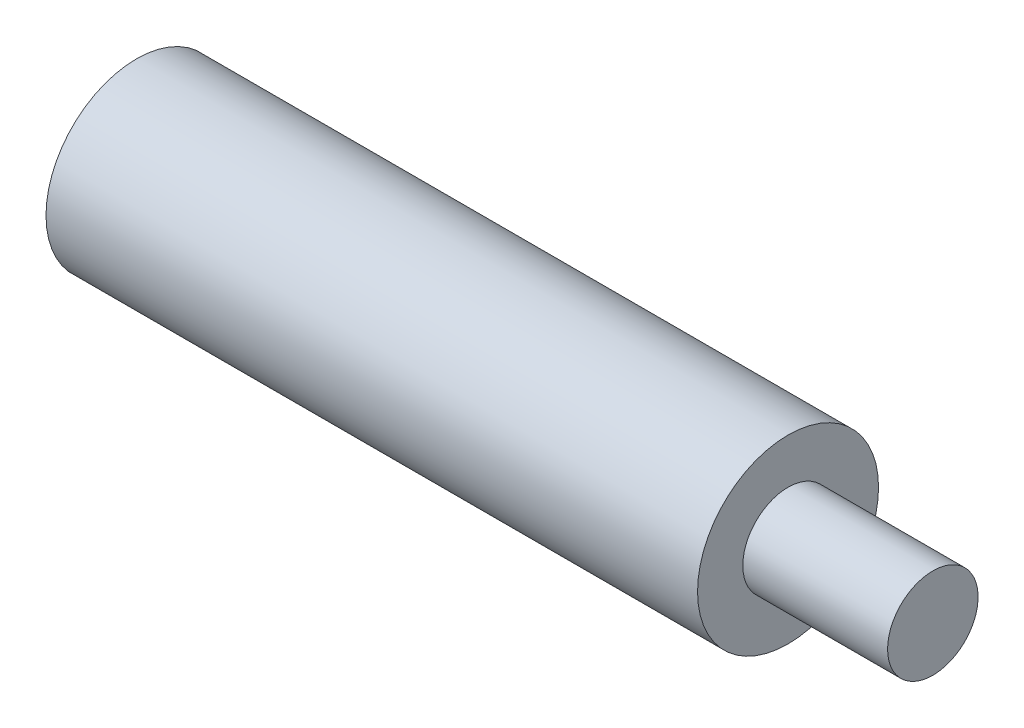
ISO-10303-21;
HEADER;
FILE_DESCRIPTION(('STEP AP214'),'2;1');
FILE_NAME('part.step','',(''),(''),'','','');
FILE_SCHEMA(('AUTOMOTIVE_DESIGN { 1 0 10303 214 1 1 1 1 }'));
ENDSEC;
DATA;
#1=APPLICATION_CONTEXT('core data for automotive mechanical design processes');
#2=APPLICATION_PROTOCOL_DEFINITION('international standard','automotive_design',2000,#1);
#3=PRODUCT_CONTEXT('',#1,'mechanical');
#4=PRODUCT('Part','Part','',(#3));
#5=PRODUCT_RELATED_PRODUCT_CATEGORY('part','',(#4));
#6=PRODUCT_DEFINITION_FORMATION('','',#4);
#7=PRODUCT_DEFINITION_CONTEXT('part definition',#1,'design');
#8=PRODUCT_DEFINITION('design','',#6,#7);
#9=PRODUCT_DEFINITION_SHAPE('','',#8);
#10=(LENGTH_UNIT() NAMED_UNIT(*) SI_UNIT(.MILLI.,.METRE.));
#11=(NAMED_UNIT(*) PLANE_ANGLE_UNIT() SI_UNIT($,.RADIAN.));
#12=(NAMED_UNIT(*) SI_UNIT($,.STERADIAN.) SOLID_ANGLE_UNIT());
#13=UNCERTAINTY_MEASURE_WITH_UNIT(LENGTH_MEASURE(1.E-05),#10,'distance_accuracy_value','');
#14=(GEOMETRIC_REPRESENTATION_CONTEXT(3) GLOBAL_UNCERTAINTY_ASSIGNED_CONTEXT((#13)) GLOBAL_UNIT_ASSIGNED_CONTEXT((#10,
#11,#12)) REPRESENTATION_CONTEXT('',''));
#15=CARTESIAN_POINT('',(0.,0.,0.));
#16=DIRECTION('',(0.,0.,1.));
#17=DIRECTION('',(1.,0.,0.));
#18=AXIS2_PLACEMENT_3D('',#15,#16,#17);
#19=CARTESIAN_POINT('',(0.,0.,0.));
#20=DIRECTION('',(1.,0.,0.));
#21=DIRECTION('',(0.,0.,-1.));
#22=AXIS2_PLACEMENT_3D('',#19,#20,#21);
#23=PLANE('',#22);
#24=CARTESIAN_POINT('',(0.,0.,0.));
#25=DIRECTION('',(-1.,0.,0.));
#26=DIRECTION('',(0.,0.,1.));
#27=AXIS2_PLACEMENT_3D('',#24,#25,#26);
#28=CIRCLE('',#27,2.09999999999999);
#29=CARTESIAN_POINT('',(0.,0.,2.09999999999999));
#30=VERTEX_POINT('',#29);
#31=EDGE_CURVE('E59',#30,#30,#28,.T.);
#32=ORIENTED_EDGE('',*,*,#31,.F.);
#33=EDGE_LOOP('',(#32));
#34=FACE_BOUND('',#33,.T.);
#35=CARTESIAN_POINT('',(0.,0.,0.));
#36=DIRECTION('',(-1.,0.,0.));
#37=DIRECTION('',(0.,0.,1.));
#38=AXIS2_PLACEMENT_3D('',#35,#36,#37);
#39=CIRCLE('',#38,5.);
#40=CARTESIAN_POINT('',(0.,0.,5.));
#41=VERTEX_POINT('',#40);
#42=EDGE_CURVE('E11',#41,#41,#39,.T.);
#43=ORIENTED_EDGE('',*,*,#42,.T.);
#44=EDGE_LOOP('',(#43));
#45=FACE_BOUND('',#44,.T.);
#46=ADVANCED_FACE('F39',(#34,#45),#23,.F.);
#47=CARTESIAN_POINT('',(0.,0.,0.));
#48=DIRECTION('',(-1.,0.,0.));
#49=DIRECTION('',(0.,0.,1.));
#50=AXIS2_PLACEMENT_3D('',#47,#48,#49);
#51=CYLINDRICAL_SURFACE('',#50,5.);
#52=ORIENTED_EDGE('',*,*,#42,.F.);
#53=EDGE_LOOP('',(#52));
#54=FACE_BOUND('',#53,.T.);
#55=CARTESIAN_POINT('',(36.,0.,0.));
#56=DIRECTION('',(-1.,0.,0.));
#57=DIRECTION('',(0.,0.,1.));
#58=AXIS2_PLACEMENT_3D('',#55,#56,#57);
#59=CIRCLE('',#58,5.);
#60=CARTESIAN_POINT('',(36.,0.,5.));
#61=VERTEX_POINT('',#60);
#62=EDGE_CURVE('E45',#61,#61,#59,.T.);
#63=ORIENTED_EDGE('',*,*,#62,.T.);
#64=EDGE_LOOP('',(#63));
#65=FACE_BOUND('',#64,.T.);
#66=ADVANCED_FACE('F71',(#54,#65),#51,.T.);
#67=CARTESIAN_POINT('',(36.,5.,0.));
#68=DIRECTION('',(-1.,0.,0.));
#69=DIRECTION('',(0.,0.,1.));
#70=AXIS2_PLACEMENT_3D('',#67,#68,#69);
#71=PLANE('',#70);
#72=ORIENTED_EDGE('',*,*,#62,.F.);
#73=EDGE_LOOP('',(#72));
#74=FACE_BOUND('',#73,.T.);
#75=CARTESIAN_POINT('',(36.,0.,0.));
#76=DIRECTION('',(-1.,0.,0.));
#77=DIRECTION('',(0.,0.,1.));
#78=AXIS2_PLACEMENT_3D('',#75,#76,#77);
#79=CIRCLE('',#78,2.5);
#80=CARTESIAN_POINT('',(36.,0.,2.5));
#81=VERTEX_POINT('',#80);
#82=EDGE_CURVE('E62',#81,#81,#79,.T.);
#83=ORIENTED_EDGE('',*,*,#82,.T.);
#84=EDGE_LOOP('',(#83));
#85=FACE_BOUND('',#84,.T.);
#86=ADVANCED_FACE('F73',(#74,#85),#71,.F.);
#87=CARTESIAN_POINT('',(0.,0.,0.));
#88=DIRECTION('',(-1.,0.,0.));
#89=DIRECTION('',(0.,0.,1.));
#90=AXIS2_PLACEMENT_3D('',#87,#88,#89);
#91=CYLINDRICAL_SURFACE('',#90,2.5);
#92=ORIENTED_EDGE('',*,*,#82,.F.);
#93=EDGE_LOOP('',(#92));
#94=FACE_BOUND('',#93,.T.);
#95=CARTESIAN_POINT('',(44.,0.,0.));
#96=DIRECTION('',(-1.,0.,0.));
#97=DIRECTION('',(0.,0.,1.));
#98=AXIS2_PLACEMENT_3D('',#95,#96,#97);
#99=CIRCLE('',#98,2.5);
#100=CARTESIAN_POINT('',(44.,0.,2.5));
#101=VERTEX_POINT('',#100);
#102=EDGE_CURVE('E58',#101,#101,#99,.T.);
#103=ORIENTED_EDGE('',*,*,#102,.T.);
#104=EDGE_LOOP('',(#103));
#105=FACE_BOUND('',#104,.T.);
#106=ADVANCED_FACE('F76',(#94,#105),#91,.T.);
#107=CARTESIAN_POINT('',(44.,2.5,0.));
#108=DIRECTION('',(-1.,0.,0.));
#109=DIRECTION('',(0.,0.,1.));
#110=AXIS2_PLACEMENT_3D('',#107,#108,#109);
#111=PLANE('',#110);
#112=ORIENTED_EDGE('',*,*,#102,.F.);
#113=EDGE_LOOP('',(#112));
#114=FACE_BOUND('',#113,.T.);
#115=ADVANCED_FACE('F52',(#114),#111,.F.);
#116=CARTESIAN_POINT('',(14.,0.,0.));
#117=DIRECTION('',(-1.,0.,0.));
#118=DIRECTION('',(0.,0.,1.));
#119=AXIS2_PLACEMENT_3D('',#116,#117,#118);
#120=CONICAL_SURFACE('',#119,2.09999999999999,1.02974425867665);
#121=CARTESIAN_POINT('',(15.2618072999579,0.,0.));
#122=VERTEX_POINT('',#121);
#123=VERTEX_LOOP('',#122);
#124=FACE_BOUND('',#123,.T.);
#125=CARTESIAN_POINT('',(14.,0.,0.));
#126=DIRECTION('',(-1.,0.,0.));
#127=DIRECTION('',(0.,0.,1.));
#128=AXIS2_PLACEMENT_3D('',#125,#126,#127);
#129=CIRCLE('',#128,2.09999999999999);
#130=CARTESIAN_POINT('',(14.,0.,2.09999999999999));
#131=VERTEX_POINT('',#130);
#132=EDGE_CURVE('E56',#131,#131,#129,.T.);
#133=ORIENTED_EDGE('',*,*,#132,.T.);
#134=EDGE_LOOP('',(#133));
#135=FACE_BOUND('',#134,.T.);
#136=ADVANCED_FACE('F48',(#124,#135),#120,.F.);
#137=CARTESIAN_POINT('',(0.,0.,0.));
#138=DIRECTION('',(-1.,0.,0.));
#139=DIRECTION('',(0.,0.,1.));
#140=AXIS2_PLACEMENT_3D('',#137,#138,#139);
#141=CYLINDRICAL_SURFACE('',#140,2.09999999999999);
#142=ORIENTED_EDGE('',*,*,#132,.F.);
#143=EDGE_LOOP('',(#142));
#144=FACE_BOUND('',#143,.T.);
#145=ORIENTED_EDGE('',*,*,#31,.T.);
#146=EDGE_LOOP('',(#145));
#147=FACE_BOUND('',#146,.T.);
#148=ADVANCED_FACE('F51',(#144,#147),#141,.F.);
#149=CLOSED_SHELL('',(#46,#66,#86,#106,#115,#136,#148));
#150=MANIFOLD_SOLID_BREP('B2',#149);
#151=ADVANCED_BREP_SHAPE_REPRESENTATION('',(#18,#150),#14);
#152=SHAPE_DEFINITION_REPRESENTATION(#9,#151);
ENDSEC;
END-ISO-10303-21;
